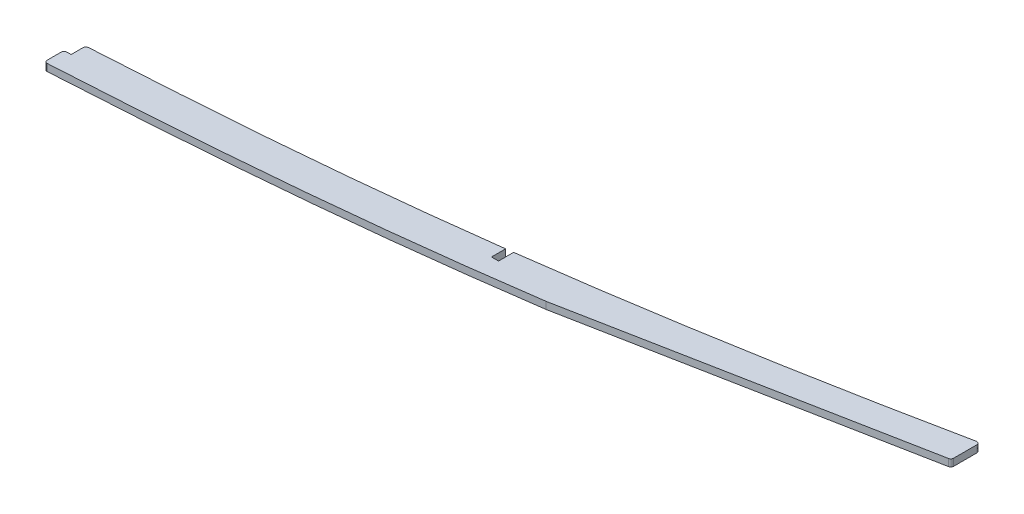
ISO-10303-21;
HEADER;
FILE_DESCRIPTION(('STEP AP214'),'2;1');
FILE_NAME('part.step','',(''),(''),'','','');
FILE_SCHEMA(('AUTOMOTIVE_DESIGN { 1 0 10303 214 1 1 1 1 }'));
ENDSEC;
DATA;
#1=APPLICATION_CONTEXT('core data for automotive mechanical design processes');
#2=APPLICATION_PROTOCOL_DEFINITION('international standard','automotive_design',2000,#1);
#3=PRODUCT_CONTEXT('',#1,'mechanical');
#4=PRODUCT('Part','Part','',(#3));
#5=PRODUCT_RELATED_PRODUCT_CATEGORY('part','',(#4));
#6=PRODUCT_DEFINITION_FORMATION('','',#4);
#7=PRODUCT_DEFINITION_CONTEXT('part definition',#1,'design');
#8=PRODUCT_DEFINITION('design','',#6,#7);
#9=PRODUCT_DEFINITION_SHAPE('','',#8);
#10=(LENGTH_UNIT() NAMED_UNIT(*) SI_UNIT(.MILLI.,.METRE.));
#11=(NAMED_UNIT(*) PLANE_ANGLE_UNIT() SI_UNIT($,.RADIAN.));
#12=(NAMED_UNIT(*) SI_UNIT($,.STERADIAN.) SOLID_ANGLE_UNIT());
#13=UNCERTAINTY_MEASURE_WITH_UNIT(LENGTH_MEASURE(1.E-05),#10,'distance_accuracy_value','');
#14=(GEOMETRIC_REPRESENTATION_CONTEXT(3) GLOBAL_UNCERTAINTY_ASSIGNED_CONTEXT((#13)) GLOBAL_UNIT_ASSIGNED_CONTEXT((#10,
#11,#12)) REPRESENTATION_CONTEXT('',''));
#15=CARTESIAN_POINT('',(0.,0.,0.));
#16=DIRECTION('',(0.,0.,1.));
#17=DIRECTION('',(1.,0.,0.));
#18=AXIS2_PLACEMENT_3D('',#15,#16,#17);
#19=CARTESIAN_POINT('',(2125.00064017427,1.5875,94.4800369448474));
#20=CARTESIAN_POINT('',(2149.04351205278,1.5875,93.497408198186));
#21=CARTESIAN_POINT('',(2173.08465693507,1.5875,92.4714303186568));
#22=CARTESIAN_POINT('',(2221.16051111618,1.5875,90.2825451342161));
#23=CARTESIAN_POINT('',(2245.19553408109,1.5875,89.1196551679897));
#24=CARTESIAN_POINT('',(2281.23975724731,1.5875,87.2213575710183));
#25=CARTESIAN_POINT('',(2293.25302693238,1.5875,86.5622387735997));
#26=CARTESIAN_POINT('',(2317.27629287288,1.5875,85.1853725215189));
#27=CARTESIAN_POINT('',(2329.28667496271,1.5875,84.4695877060572));
#28=CARTESIAN_POINT('',(2353.30043194924,1.5875,82.9360976908141));
#29=CARTESIAN_POINT('',(2365.30329886088,1.5875,82.1167454790412));
#30=CARTESIAN_POINT('',(2389.29570022096,1.5875,80.3032013832875));
#31=CARTESIAN_POINT('',(2401.28513168761,1.5875,79.3076590137664));
#32=CARTESIAN_POINT('',(2425.248015539,1.5875,77.1070272915958));
#33=CARTESIAN_POINT('',(2437.21939504412,1.5875,75.9021262287262));
#34=CARTESIAN_POINT('',(2461.1350429249,1.5875,73.2728607205226));
#35=CARTESIAN_POINT('',(2473.08021873022,1.5875,71.848649743833));
#36=CARTESIAN_POINT('',(2496.94588972892,1.5875,68.7864051538839));
#37=CARTESIAN_POINT('',(2508.86721006671,1.5875,67.1484398221377));
#38=CARTESIAN_POINT('',(2532.67675150176,1.5875,63.6755945009625));
#39=CARTESIAN_POINT('',(2544.56619473404,1.5875,61.8407677680709));
#40=CARTESIAN_POINT('',(2568.31735906903,1.5875,57.9931353056948));
#41=CARTESIAN_POINT('',(2580.17961126629,1.5875,55.980432346589));
#42=CARTESIAN_POINT('',(2603.8765766664,1.5875,51.794563265322));
#43=CARTESIAN_POINT('',(2615.71090980775,1.5875,49.6216949956207));
#44=CARTESIAN_POINT('',(2639.35036015543,1.5875,45.1250865007013));
#45=CARTESIAN_POINT('',(2651.15621950326,1.5875,42.8015133301686));
#46=CARTESIAN_POINT('',(2674.73471693345,1.5875,37.9973454558139));
#47=CARTESIAN_POINT('',(2686.50776170266,1.5875,35.5172707099935));
#48=CARTESIAN_POINT('',(2698.26092171884,1.5875,32.9414891543206));
#49=B_SPLINE_CURVE_WITH_KNOTS('',3,(#19,#20,#21,#22,#23,#24,#25,#26,#27,#28,#29,#30,#31,#32,#33,
#34,#35,#36,#37,#38,#39,#40,#41,#42,#43,#44,#45,#46,#47,#48),.UNSPECIFIED.,.F.,.F.,(4,2,2,2,2,2,
2,2,2,2,2,2,2,2,4),(0.,0.125,0.25,0.3125,0.375,0.4375,0.5,0.5625,0.625,0.6875,0.75,0.8125,0.875,
0.9375,1.),.UNSPECIFIED.);
#50=DIRECTION('',(0.,-1.,0.));
#51=VECTOR('',#50,1.);
#52=SURFACE_OF_LINEAR_EXTRUSION('',#49,#51);
#53=CARTESIAN_POINT('',(2517.14075146026,1.5875,65.9385305900614));
#54=CARTESIAN_POINT('',(2506.44324518488,1.5875,67.4803671494609));
#55=CARTESIAN_POINT('',(2495.73279615856,1.5875,68.9420592405899));
#56=CARTESIAN_POINT('',(2473.08021873022,1.5875,71.848649743833));
#57=CARTESIAN_POINT('',(2461.1350429249,1.5875,73.2728607205226));
#58=CARTESIAN_POINT('',(2437.21939504412,1.5875,75.9021262287262));
#59=CARTESIAN_POINT('',(2425.248015539,1.5875,77.1070272915958));
#60=CARTESIAN_POINT('',(2401.28513168761,1.5875,79.3076590137664));
#61=CARTESIAN_POINT('',(2389.29570022096,1.5875,80.3032013832875));
#62=CARTESIAN_POINT('',(2365.30329886088,1.5875,82.1167454790412));
#63=CARTESIAN_POINT('',(2353.30043194924,1.5875,82.9360976908141));
#64=CARTESIAN_POINT('',(2331.77885363362,1.5875,84.3104401345136));
#65=CARTESIAN_POINT('',(2322.26195370306,1.5875,84.8860367578641));
#66=CARTESIAN_POINT('',(2312.74397465339,1.5875,85.4413805531746));
#67=B_SPLINE_CURVE_WITH_KNOTS('',3,(#53,#54,#55,#56,#57,#58,#59,#60,#61,#62,#63,#64,#65,#66),
.UNSPECIFIED.,.F.,.F.,(4,2,2,2,2,2,4),(0.3254726612141,0.381618903286955,0.444118903286955,
0.506618903286955,0.569118903286955,0.631618903286955,0.681146242072855),.UNSPECIFIED.);
#68=CARTESIAN_POINT('',(2312.74398306396,1.5875,85.4415247011197));
#69=VERTEX_POINT('',#68);
#70=CARTESIAN_POINT('',(2517.14074629758,1.5875,65.9384947733818));
#71=VERTEX_POINT('',#70);
#72=EDGE_CURVE('E311',#69,#71,#67,.F.);
#73=ORIENTED_EDGE('',*,*,#72,.F.);
#74=DIRECTION('',(0.,-1.,0.));
#75=VECTOR('',#74,1.);
#76=CARTESIAN_POINT('',(2312.74397464853,1.5875,85.4413805534581));
#77=LINE('',#76,#75);
#78=CARTESIAN_POINT('',(2312.74398306217,-1.5875,85.4415246869222));
#79=VERTEX_POINT('',#78);
#80=EDGE_CURVE('E395',#69,#79,#77,.T.);
#81=ORIENTED_EDGE('',*,*,#80,.T.);
#82=CARTESIAN_POINT('',(2312.74397465001,-1.5875,85.4413805533716));
#83=CARTESIAN_POINT('',(2322.2619537008,-1.5875,84.8860367580003));
#84=CARTESIAN_POINT('',(2331.7788536325,-1.5875,84.3104401345854));
#85=CARTESIAN_POINT('',(2353.30043194924,-1.5875,82.9360976908141));
#86=CARTESIAN_POINT('',(2365.30329886088,-1.5875,82.1167454790412));
#87=CARTESIAN_POINT('',(2389.29570022096,-1.5875,80.3032013832875));
#88=CARTESIAN_POINT('',(2401.28513168761,-1.5875,79.3076590137664));
#89=CARTESIAN_POINT('',(2425.248015539,-1.5875,77.1070272915958));
#90=CARTESIAN_POINT('',(2437.21939504412,-1.5875,75.9021262287262));
#91=CARTESIAN_POINT('',(2461.1350429249,-1.5875,73.2728607205226));
#92=CARTESIAN_POINT('',(2473.08021873022,-1.5875,71.848649743833));
#93=CARTESIAN_POINT('',(2495.73279679608,-1.5875,68.9420591587886));
#94=CARTESIAN_POINT('',(2506.44324645882,-1.5875,67.4803669756025));
#95=CARTESIAN_POINT('',(2517.14075336885,-1.5875,65.9385303149748));
#96=B_SPLINE_CURVE_WITH_KNOTS('',3,(#82,#83,#84,#85,#86,#87,#88,#89,#90,#91,#92,#93,#94,#95),
.UNSPECIFIED.,.F.,.F.,(4,2,2,2,2,2,4),(0.325472661208244,0.375,0.4375,0.5,0.5625,0.625,
0.681146245411964),.UNSPECIFIED.);
#97=CARTESIAN_POINT('',(2517.14043307902,-1.58960583541235,65.9385552624042));
#98=VERTEX_POINT('',#97);
#99=EDGE_CURVE('E184',#79,#98,#96,.T.);
#100=ORIENTED_EDGE('',*,*,#99,.T.);
#101=DIRECTION('',(0.,-1.,0.));
#102=VECTOR('',#101,1.);
#103=CARTESIAN_POINT('',(2517.14,-0.0024999999999999,65.9386388982431));
#104=LINE('',#103,#102);
#105=EDGE_CURVE('E279',#98,#71,#104,.F.);
#106=ORIENTED_EDGE('',*,*,#105,.T.);
#107=EDGE_LOOP('',(#73,#81,#100,#106));
#108=FACE_BOUND('',#107,.T.);
#109=ADVANCED_FACE('F47',(#108),#52,.F.);
#110=CARTESIAN_POINT('',(2124.37830308858,1.5875,79.252749052653));
#111=CARTESIAN_POINT('',(2148.39751193199,1.5875,78.2710874108631));
#112=CARTESIAN_POINT('',(2196.44142591429,1.5875,76.2202304627624));
#113=CARTESIAN_POINT('',(2256.43632671494,1.5875,73.3193029777612));
#114=CARTESIAN_POINT('',(2304.39682766951,1.5875,70.6868537158113));
#115=CARTESIAN_POINT('',(2340.34200336636,1.5875,68.5440440460852));
#116=CARTESIAN_POINT('',(2376.16909953384,1.5875,66.0999017724206));
#117=CARTESIAN_POINT('',(2423.79225447921,1.5875,62.148433446528));
#118=CARTESIAN_POINT('',(2483.11730251875,1.5875,55.6326510171635));
#119=CARTESIAN_POINT('',(2554.04445691108,1.5875,45.2265308139822));
#120=CARTESIAN_POINT('',(2611.9061277636,1.5875,34.9727556057638));
#121=CARTESIAN_POINT('',(2648.22954061154,1.5875,27.8453657370829));
#122=CARTESIAN_POINT('',(2665.29052708524,1.5875,24.3690973591681));
#123=CARTESIAN_POINT('',(2678.0413738897,1.5875,21.7219433950603));
#124=CARTESIAN_POINT('',(2688.64049273064,1.5875,19.4481755033962));
#125=CARTESIAN_POINT('',(2694.99840626553,1.5875,18.0547973486536));
#126=B_SPLINE_CURVE_WITH_KNOTS('',3,(#110,#111,#112,#113,#114,#115,#116,#117,#118,#119,#120,
#121,#122,#123,#124,#125),.UNSPECIFIED.,.F.,.F.,(4,1,1,1,1,1,1,1,1,1,1,1,1,4),(0.,0.125,0.25,
0.3125,0.375,0.4375,0.5,0.625,0.75,0.875,0.931953524477232,0.943294603731027,0.965976762238616,
1.),.UNSPECIFIED.);
#127=DIRECTION('',(0.,-1.,0.));
#128=VECTOR('',#127,1.);
#129=SURFACE_OF_LINEAR_EXTRUSION('',#126,#128);
#130=CARTESIAN_POINT('',(2487.61258124876,-1.5875,54.6140340984797));
#131=CARTESIAN_POINT('',(2486.09972739751,-1.5875,54.8115871458127));
#132=CARTESIAN_POINT('',(2460.90329305909,-1.5875,58.0724577650065));
#133=CARTESIAN_POINT('',(2423.79225447921,-1.5875,62.148433446528));
#134=CARTESIAN_POINT('',(2376.16909953384,-1.5875,66.0999017724206));
#135=CARTESIAN_POINT('',(2344.12135262642,-1.5875,68.2862149647029));
#136=CARTESIAN_POINT('',(2323.96019254909,-1.5875,69.5154701849957));
#137=CARTESIAN_POINT('',(2315.77027851908,-1.5875,69.9981689116351));
#138=B_SPLINE_CURVE_WITH_KNOTS('',3,(#130,#131,#132,#133,#134,#135,#136,#137),.UNSPECIFIED.,.F.,
.F.,(4,1,1,1,1,4),(0.332279107493079,0.340264824562933,0.465264824562933,0.527764824562933,
0.590264824562933,0.632985717069855),.UNSPECIFIED.);
#139=CARTESIAN_POINT('',(2315.7703230098,-1.5875,69.9989237825159));
#140=VERTEX_POINT('',#139);
#141=CARTESIAN_POINT('',(2487.61249997359,-1.58964788720698,54.6136835370382));
#142=VERTEX_POINT('',#141);
#143=EDGE_CURVE('E257',#140,#142,#138,.F.);
#144=ORIENTED_EDGE('',*,*,#143,.F.);
#145=DIRECTION('',(0.,-1.,0.));
#146=VECTOR('',#145,1.);
#147=CARTESIAN_POINT('',(2315.77027816457,-1.5875,69.9981689325292));
#148=LINE('',#147,#146);
#149=CARTESIAN_POINT('',(2315.77027816457,1.5875,69.9981689325292));
#150=VERTEX_POINT('',#149);
#151=EDGE_CURVE('E259',#140,#150,#148,.F.);
#152=ORIENTED_EDGE('',*,*,#151,.T.);
#153=CARTESIAN_POINT('',(2487.6125,1.5875,54.6140447081878));
#154=VERTEX_POINT('',#153);
#155=EDGE_CURVE('E199',#150,#154,#126,.T.);
#156=ORIENTED_EDGE('',*,*,#155,.T.);
#157=DIRECTION('',(0.,1.,0.));
#158=VECTOR('',#157,1.);
#159=CARTESIAN_POINT('',(2487.6125,-1.5925,54.6140447081878));
#160=LINE('',#159,#158);
#161=EDGE_CURVE('E289',#142,#154,#160,.T.);
#162=ORIENTED_EDGE('',*,*,#161,.F.);
#163=EDGE_LOOP('',(#144,#152,#156,#162));
#164=FACE_BOUND('',#163,.T.);
#165=ADVANCED_FACE('F231',(#164),#129,.T.);
#166=CARTESIAN_POINT('',(2669.54,1.5875,7.61745278554091E-11));
#167=DIRECTION('',(-1.,0.,0.));
#168=DIRECTION('',(0.,0.,1.));
#169=AXIS2_PLACEMENT_3D('',#166,#167,#168);
#170=PLANE('',#169);
#171=DIRECTION('',(0.,0.,-1.));
#172=VECTOR('',#171,1.);
#173=CARTESIAN_POINT('',(2669.54,-1.5875,7.61745278554091E-11));
#174=LINE('',#173,#172);
#175=CARTESIAN_POINT('',(2669.54,-1.5875,35.4589734963627));
#176=VERTEX_POINT('',#175);
#177=CARTESIAN_POINT('',(2669.54,-1.5875,25.0443756031255));
#178=VERTEX_POINT('',#177);
#179=EDGE_CURVE('E417',#176,#178,#174,.T.);
#180=ORIENTED_EDGE('',*,*,#179,.T.);
#181=DIRECTION('',(0.,1.,0.));
#182=VECTOR('',#181,1.);
#183=CARTESIAN_POINT('',(2669.54,1.5875,25.0443756031255));
#184=LINE('',#183,#182);
#185=CARTESIAN_POINT('',(2669.54,1.5875,25.0443756031255));
#186=VERTEX_POINT('',#185);
#187=EDGE_CURVE('E386',#178,#186,#184,.T.);
#188=ORIENTED_EDGE('',*,*,#187,.T.);
#189=DIRECTION('',(0.,0.,-1.));
#190=VECTOR('',#189,1.);
#191=CARTESIAN_POINT('',(2669.54,1.5875,7.61745278554091E-11));
#192=LINE('',#191,#190);
#193=CARTESIAN_POINT('',(2669.54,1.5875,35.4589734963627));
#194=VERTEX_POINT('',#193);
#195=EDGE_CURVE('E306',#194,#186,#192,.T.);
#196=ORIENTED_EDGE('',*,*,#195,.F.);
#197=DIRECTION('',(0.,1.,0.));
#198=VECTOR('',#197,1.);
#199=CARTESIAN_POINT('',(2669.54,1.5875,35.4589734963627));
#200=LINE('',#199,#198);
#201=EDGE_CURVE('E381',#194,#176,#200,.F.);
#202=ORIENTED_EDGE('',*,*,#201,.T.);
#203=EDGE_LOOP('',(#180,#188,#196,#202));
#204=FACE_BOUND('',#203,.T.);
#205=ADVANCED_FACE('F229',(#204),#170,.F.);
#206=CARTESIAN_POINT('',(2490.78749999026,1.5875,54.1968621651898));
#207=VERTEX_POINT('',#206);
#208=CARTESIAN_POINT('',(2668.01254575253,1.5875,23.8007449061504));
#209=VERTEX_POINT('',#208);
#210=EDGE_CURVE('E194',#207,#209,#126,.T.);
#211=ORIENTED_EDGE('',*,*,#210,.T.);
#212=DIRECTION('',(0.,-1.,0.));
#213=VECTOR('',#212,1.);
#214=CARTESIAN_POINT('',(2668.01254575253,1.5875,23.8007449061503));
#215=LINE('',#214,#213);
#216=CARTESIAN_POINT('',(2668.01254788894,-1.5875,23.8007552219838));
#217=VERTEX_POINT('',#216);
#218=EDGE_CURVE('E375',#209,#217,#215,.T.);
#219=ORIENTED_EDGE('',*,*,#218,.T.);
#220=CARTESIAN_POINT('',(2668.01254575334,-1.5875,23.8007449059823));
#221=CARTESIAN_POINT('',(2666.39648104322,-1.5875,24.13529979018));
#222=CARTESIAN_POINT('',(2662.65415415635,-1.5875,24.9062726191806));
#223=CARTESIAN_POINT('',(2648.22954061154,-1.5875,27.8453657370829));
#224=CARTESIAN_POINT('',(2611.9061277636,-1.5875,34.9727556057638));
#225=CARTESIAN_POINT('',(2556.60294893084,-1.5875,44.7731356448457));
#226=CARTESIAN_POINT('',(2511.89346831468,-1.5875,51.4065025037802));
#227=CARTESIAN_POINT('',(2490.78758843823,-1.5875,54.1968504717389));
#228=B_SPLINE_CURVE_WITH_KNOTS('',3,(#220,#221,#222,#223,#224,#225,#226,#227),.UNSPECIFIED.,.F.,
.F.,(4,1,1,1,1,4),(0.638572683457684,0.647196529833476,0.658537609087271,0.715491133564503,
0.840491133564503,0.951918450106819),.UNSPECIFIED.);
#229=CARTESIAN_POINT('',(2490.7874999778,-1.58962136670422,54.1964701715005));
#230=VERTEX_POINT('',#229);
#231=EDGE_CURVE('E440',#230,#217,#228,.F.);
#232=ORIENTED_EDGE('',*,*,#231,.F.);
#233=DIRECTION('',(0.,1.,0.));
#234=VECTOR('',#233,1.);
#235=CARTESIAN_POINT('',(2490.78749999026,-1.5925,54.1968621651898));
#236=LINE('',#235,#234);
#237=EDGE_CURVE('E292',#230,#207,#236,.T.);
#238=ORIENTED_EDGE('',*,*,#237,.T.);
#239=EDGE_LOOP('',(#211,#219,#232,#238));
#240=FACE_BOUND('',#239,.T.);
#241=ADVANCED_FACE('F224',(#240),#129,.T.);
#242=CARTESIAN_POINT('',(0.,1.5875,0.));
#243=DIRECTION('',(0.,1.,0.));
#244=DIRECTION('',(0.,0.,1.));
#245=AXIS2_PLACEMENT_3D('',#242,#243,#244);
#246=PLANE('',#245);
#247=ORIENTED_EDGE('',*,*,#155,.F.);
#248=CARTESIAN_POINT('',(2315.845,1.5875,71.2659688565353));
#249=DIRECTION('',(0.,1.,0.));
#250=DIRECTION('',(0.,0.,1.));
#251=AXIS2_PLACEMENT_3D('',#248,#249,#250);
#252=CIRCLE('',#251,1.27);
#253=CARTESIAN_POINT('',(2314.575,1.5875,71.2659688565353));
#254=VERTEX_POINT('',#253);
#255=EDGE_CURVE('E188',#150,#254,#252,.T.);
#256=ORIENTED_EDGE('',*,*,#255,.T.);
#257=DIRECTION('',(0.,0.,-1.));
#258=VECTOR('',#257,1.);
#259=CARTESIAN_POINT('',(2314.575,1.5875,0.));
#260=LINE('',#259,#258);
#261=CARTESIAN_POINT('',(2314.575,1.5875,76.6042072105905));
#262=VERTEX_POINT('',#261);
#263=EDGE_CURVE('E173',#262,#254,#260,.T.);
#264=ORIENTED_EDGE('',*,*,#263,.F.);
#265=DIRECTION('',(1.,0.,0.));
#266=VECTOR('',#265,1.);
#267=CARTESIAN_POINT('',(0.,1.5875,76.6042072105905));
#268=LINE('',#267,#266);
#269=CARTESIAN_POINT('',(2312.67,1.5875,76.6042072105905));
#270=VERTEX_POINT('',#269);
#271=EDGE_CURVE('E164',#270,#262,#268,.T.);
#272=ORIENTED_EDGE('',*,*,#271,.F.);
#273=CARTESIAN_POINT('',(2312.67,1.5875,77.8742072105905));
#274=DIRECTION('',(0.,1.,0.));
#275=DIRECTION('',(0.,0.,1.));
#276=AXIS2_PLACEMENT_3D('',#273,#274,#275);
#277=CIRCLE('',#276,1.27);
#278=CARTESIAN_POINT('',(2311.4,1.5875,77.8742072105905));
#279=VERTEX_POINT('',#278);
#280=EDGE_CURVE('E421',#270,#279,#277,.T.);
#281=ORIENTED_EDGE('',*,*,#280,.T.);
#282=DIRECTION('',(0.,0.,1.));
#283=VECTOR('',#282,1.);
#284=CARTESIAN_POINT('',(2311.4,1.5875,6.72412135142371E-11));
#285=LINE('',#284,#283);
#286=CARTESIAN_POINT('',(2311.4,1.5875,84.1735368125441));
#287=VERTEX_POINT('',#286);
#288=EDGE_CURVE('E174',#279,#287,#285,.T.);
#289=ORIENTED_EDGE('',*,*,#288,.T.);
#290=CARTESIAN_POINT('',(2312.67,1.5875,84.1735368125441));
#291=DIRECTION('',(0.,1.,0.));
#292=DIRECTION('',(0.,0.,1.));
#293=AXIS2_PLACEMENT_3D('',#290,#291,#292);
#294=CIRCLE('',#293,1.27);
#295=EDGE_CURVE('E419',#287,#69,#294,.T.);
#296=ORIENTED_EDGE('',*,*,#295,.T.);
#297=ORIENTED_EDGE('',*,*,#72,.T.);
#298=DIRECTION('',(-0.981858268087982,0.,0.189616300426069));
#299=VECTOR('',#298,1.);
#300=CARTESIAN_POINT('',(102.778324828958,1.5875,532.199751744926));
#301=LINE('',#300,#299);
#302=CARTESIAN_POINT('',(2668.51081270154,1.5875,36.7059334968343));
#303=VERTEX_POINT('',#302);
#304=EDGE_CURVE('E296',#303,#71,#301,.T.);
#305=ORIENTED_EDGE('',*,*,#304,.F.);
#306=CARTESIAN_POINT('',(2668.27,1.5875,35.4589734963626));
#307=DIRECTION('',(0.,1.,0.));
#308=DIRECTION('',(0.,0.,1.));
#309=AXIS2_PLACEMENT_3D('',#306,#307,#308);
#310=CIRCLE('',#309,1.27);
#311=EDGE_CURVE('E262',#303,#194,#310,.T.);
#312=ORIENTED_EDGE('',*,*,#311,.T.);
#313=ORIENTED_EDGE('',*,*,#195,.T.);
#314=CARTESIAN_POINT('',(2668.27,1.5875,25.0443756031255));
#315=DIRECTION('',(0.,1.,0.));
#316=DIRECTION('',(0.,0.,1.));
#317=AXIS2_PLACEMENT_3D('',#314,#315,#316);
#318=CIRCLE('',#317,1.27);
#319=EDGE_CURVE('E426',#186,#209,#318,.T.);
#320=ORIENTED_EDGE('',*,*,#319,.T.);
#321=ORIENTED_EDGE('',*,*,#210,.F.);
#322=DIRECTION('',(0.,0.,-1.));
#323=VECTOR('',#322,1.);
#324=CARTESIAN_POINT('',(2490.7875,1.5875,-1.6345529996214E-10));
#325=LINE('',#324,#323);
#326=CARTESIAN_POINT('',(2490.7875,1.5875,60.9640446821163));
#327=VERTEX_POINT('',#326);
#328=EDGE_CURVE('E278',#327,#207,#325,.T.);
#329=ORIENTED_EDGE('',*,*,#328,.F.);
#330=DIRECTION('',(1.,0.,0.));
#331=VECTOR('',#330,1.);
#332=CARTESIAN_POINT('',(0.,1.5875,60.9640446821163));
#333=LINE('',#332,#331);
#334=CARTESIAN_POINT('',(2487.6125,1.5875,60.9640446821163));
#335=VERTEX_POINT('',#334);
#336=EDGE_CURVE('E274',#335,#327,#333,.T.);
#337=ORIENTED_EDGE('',*,*,#336,.F.);
#338=DIRECTION('',(0.,0.,1.));
#339=VECTOR('',#338,1.);
#340=CARTESIAN_POINT('',(2487.6125,1.5875,0.));
#341=LINE('',#340,#339);
#342=EDGE_CURVE('E282',#154,#335,#341,.T.);
#343=ORIENTED_EDGE('',*,*,#342,.F.);
#344=EDGE_LOOP('',(#247,#256,#264,#272,#281,#289,#296,#297,#305,#312,#313,#320,#321,#329,#337,#343));
#345=FACE_BOUND('',#344,.T.);
#346=ADVANCED_FACE('F187',(#345),#246,.T.);
#347=CARTESIAN_POINT('',(0.,-1.5875,0.));
#348=DIRECTION('',(0.,1.,0.));
#349=DIRECTION('',(0.,0.,1.));
#350=AXIS2_PLACEMENT_3D('',#347,#348,#349);
#351=PLANE('',#350);
#352=DIRECTION('',(0.,0.,-1.));
#353=VECTOR('',#352,1.);
#354=CARTESIAN_POINT('',(2314.575,-1.5875,0.));
#355=LINE('',#354,#353);
#356=CARTESIAN_POINT('',(2314.575,-1.5875,76.6042072105905));
#357=VERTEX_POINT('',#356);
#358=CARTESIAN_POINT('',(2314.575,-1.5875,71.2659688565353));
#359=VERTEX_POINT('',#358);
#360=EDGE_CURVE('E182',#357,#359,#355,.T.);
#361=ORIENTED_EDGE('',*,*,#360,.T.);
#362=CARTESIAN_POINT('',(2315.845,-1.5875,71.2659688565353));
#363=DIRECTION('',(0.,1.,0.));
#364=DIRECTION('',(0.,0.,1.));
#365=AXIS2_PLACEMENT_3D('',#362,#363,#364);
#366=CIRCLE('',#365,1.27);
#367=EDGE_CURVE('E370',#359,#140,#366,.F.);
#368=ORIENTED_EDGE('',*,*,#367,.T.);
#369=ORIENTED_EDGE('',*,*,#143,.T.);
#370=DIRECTION('',(0.,0.,1.));
#371=VECTOR('',#370,1.);
#372=CARTESIAN_POINT('',(2487.6125,-1.5875,0.));
#373=LINE('',#372,#371);
#374=CARTESIAN_POINT('',(2487.6125,-1.5875,60.9640446821163));
#375=VERTEX_POINT('',#374);
#376=EDGE_CURVE('E455',#142,#375,#373,.T.);
#377=ORIENTED_EDGE('',*,*,#376,.T.);
#378=DIRECTION('',(1.,0.,0.));
#379=VECTOR('',#378,1.);
#380=CARTESIAN_POINT('',(0.,-1.5875,60.9640446821163));
#381=LINE('',#380,#379);
#382=CARTESIAN_POINT('',(2490.7875,-1.5875,60.9640446821163));
#383=VERTEX_POINT('',#382);
#384=EDGE_CURVE('E449',#375,#383,#381,.T.);
#385=ORIENTED_EDGE('',*,*,#384,.T.);
#386=DIRECTION('',(0.,0.,-1.));
#387=VECTOR('',#386,1.);
#388=CARTESIAN_POINT('',(2490.7875,-1.5875,-1.6345529996214E-10));
#389=LINE('',#388,#387);
#390=EDGE_CURVE('E443',#383,#230,#389,.T.);
#391=ORIENTED_EDGE('',*,*,#390,.T.);
#392=ORIENTED_EDGE('',*,*,#231,.T.);
#393=CARTESIAN_POINT('',(2668.27,-1.5875,25.0443756031255));
#394=DIRECTION('',(0.,1.,0.));
#395=DIRECTION('',(0.,0.,1.));
#396=AXIS2_PLACEMENT_3D('',#393,#394,#395);
#397=CIRCLE('',#396,1.27);
#398=EDGE_CURVE('E360',#217,#178,#397,.F.);
#399=ORIENTED_EDGE('',*,*,#398,.T.);
#400=ORIENTED_EDGE('',*,*,#179,.F.);
#401=CARTESIAN_POINT('',(2668.27,-1.5875,35.4589734963626));
#402=DIRECTION('',(0.,1.,0.));
#403=DIRECTION('',(0.,0.,1.));
#404=AXIS2_PLACEMENT_3D('',#401,#402,#403);
#405=CIRCLE('',#404,1.27);
#406=CARTESIAN_POINT('',(2668.51081270154,-1.5875,36.7059334968345));
#407=VERTEX_POINT('',#406);
#408=EDGE_CURVE('E355',#176,#407,#405,.F.);
#409=ORIENTED_EDGE('',*,*,#408,.T.);
#410=DIRECTION('',(-0.981858268087982,0.,0.189616300426069));
#411=VECTOR('',#410,1.);
#412=CARTESIAN_POINT('',(102.778324828958,-1.5875,532.199751744926));
#413=LINE('',#412,#411);
#414=EDGE_CURVE('E202',#407,#98,#413,.T.);
#415=ORIENTED_EDGE('',*,*,#414,.T.);
#416=ORIENTED_EDGE('',*,*,#99,.F.);
#417=CARTESIAN_POINT('',(2312.67,-1.5875,84.1735368125441));
#418=DIRECTION('',(0.,1.,0.));
#419=DIRECTION('',(0.,0.,1.));
#420=AXIS2_PLACEMENT_3D('',#417,#418,#419);
#421=CIRCLE('',#420,1.27);
#422=CARTESIAN_POINT('',(2311.4,-1.5875,84.1735368125441));
#423=VERTEX_POINT('',#422);
#424=EDGE_CURVE('E63',#79,#423,#421,.F.);
#425=ORIENTED_EDGE('',*,*,#424,.T.);
#426=DIRECTION('',(0.,0.,1.));
#427=VECTOR('',#426,1.);
#428=CARTESIAN_POINT('',(2311.4,-1.5875,6.72412135142371E-11));
#429=LINE('',#428,#427);
#430=CARTESIAN_POINT('',(2311.4,-1.5875,77.8742072105905));
#431=VERTEX_POINT('',#430);
#432=EDGE_CURVE('E420',#431,#423,#429,.T.);
#433=ORIENTED_EDGE('',*,*,#432,.F.);
#434=CARTESIAN_POINT('',(2312.67,-1.5875,77.8742072105905));
#435=DIRECTION('',(0.,1.,0.));
#436=DIRECTION('',(0.,0.,1.));
#437=AXIS2_PLACEMENT_3D('',#434,#435,#436);
#438=CIRCLE('',#437,1.27);
#439=CARTESIAN_POINT('',(2312.67,-1.5875,76.6042072105905));
#440=VERTEX_POINT('',#439);
#441=EDGE_CURVE('E353',#431,#440,#438,.F.);
#442=ORIENTED_EDGE('',*,*,#441,.T.);
#443=DIRECTION('',(1.,0.,0.));
#444=VECTOR('',#443,1.);
#445=CARTESIAN_POINT('',(0.,-1.5875,76.6042072105905));
#446=LINE('',#445,#444);
#447=EDGE_CURVE('E463',#440,#357,#446,.T.);
#448=ORIENTED_EDGE('',*,*,#447,.T.);
#449=EDGE_LOOP('',(#361,#368,#369,#377,#385,#391,#392,#399,#400,#409,#415,#416,#425,#433,#442,#448));
#450=FACE_BOUND('',#449,.T.);
#451=ADVANCED_FACE('F232',(#450),#351,.F.);
#452=CARTESIAN_POINT('',(102.778324828958,-1.5925,532.199751744926));
#453=DIRECTION('',(-0.189616300426069,0.,-0.981858268087982));
#454=DIRECTION('',(-0.981858268087982,0.,0.189616300426069));
#455=AXIS2_PLACEMENT_3D('',#452,#453,#454);
#456=PLANE('',#455);
#457=ORIENTED_EDGE('',*,*,#414,.F.);
#458=DIRECTION('',(0.,1.,0.));
#459=VECTOR('',#458,1.);
#460=CARTESIAN_POINT('',(2668.51081270154,-1.5925,36.7059334968344));
#461=LINE('',#460,#459);
#462=EDGE_CURVE('E11',#407,#303,#461,.T.);
#463=ORIENTED_EDGE('',*,*,#462,.T.);
#464=ORIENTED_EDGE('',*,*,#304,.T.);
#465=ORIENTED_EDGE('',*,*,#105,.F.);
#466=EDGE_LOOP('',(#457,#463,#464,#465));
#467=FACE_BOUND('',#466,.T.);
#468=ADVANCED_FACE('F513',(#467),#456,.F.);
#469=CARTESIAN_POINT('',(0.,-1.5925,60.9640446821163));
#470=DIRECTION('',(0.,0.,1.));
#471=DIRECTION('',(1.,0.,0.));
#472=AXIS2_PLACEMENT_3D('',#469,#470,#471);
#473=PLANE('',#472);
#474=DIRECTION('',(0.,1.,0.));
#475=VECTOR('',#474,1.);
#476=CARTESIAN_POINT('',(2487.6125,-1.5925,60.9640446821163));
#477=LINE('',#476,#475);
#478=EDGE_CURVE('E269',#375,#335,#477,.T.);
#479=ORIENTED_EDGE('',*,*,#478,.T.);
#480=ORIENTED_EDGE('',*,*,#336,.T.);
#481=DIRECTION('',(0.,1.,0.));
#482=VECTOR('',#481,1.);
#483=CARTESIAN_POINT('',(2490.7875,-1.5925,60.9640446821163));
#484=LINE('',#483,#482);
#485=EDGE_CURVE('E286',#383,#327,#484,.T.);
#486=ORIENTED_EDGE('',*,*,#485,.F.);
#487=ORIENTED_EDGE('',*,*,#384,.F.);
#488=EDGE_LOOP('',(#479,#480,#486,#487));
#489=FACE_BOUND('',#488,.T.);
#490=ADVANCED_FACE('F511',(#489),#473,.F.);
#491=CARTESIAN_POINT('',(2487.6125,-1.5925,0.));
#492=DIRECTION('',(-1.,0.,0.));
#493=DIRECTION('',(0.,0.,1.));
#494=AXIS2_PLACEMENT_3D('',#491,#492,#493);
#495=PLANE('',#494);
#496=ORIENTED_EDGE('',*,*,#161,.T.);
#497=ORIENTED_EDGE('',*,*,#342,.T.);
#498=ORIENTED_EDGE('',*,*,#478,.F.);
#499=ORIENTED_EDGE('',*,*,#376,.F.);
#500=EDGE_LOOP('',(#496,#497,#498,#499));
#501=FACE_BOUND('',#500,.T.);
#502=ADVANCED_FACE('F479',(#501),#495,.F.);
#503=CARTESIAN_POINT('',(2490.7875,-1.5925,-1.6345529996214E-10));
#504=DIRECTION('',(1.,0.,0.));
#505=DIRECTION('',(0.,0.,-1.));
#506=AXIS2_PLACEMENT_3D('',#503,#504,#505);
#507=PLANE('',#506);
#508=ORIENTED_EDGE('',*,*,#485,.T.);
#509=ORIENTED_EDGE('',*,*,#328,.T.);
#510=ORIENTED_EDGE('',*,*,#237,.F.);
#511=ORIENTED_EDGE('',*,*,#390,.F.);
#512=EDGE_LOOP('',(#508,#509,#510,#511));
#513=FACE_BOUND('',#512,.T.);
#514=ADVANCED_FACE('F509',(#513),#507,.F.);
#515=CARTESIAN_POINT('',(2314.575,-1.5925,0.));
#516=DIRECTION('',(1.,0.,0.));
#517=DIRECTION('',(0.,0.,-1.));
#518=AXIS2_PLACEMENT_3D('',#515,#516,#517);
#519=PLANE('',#518);
#520=ORIENTED_EDGE('',*,*,#263,.T.);
#521=DIRECTION('',(0.,1.,0.));
#522=VECTOR('',#521,1.);
#523=CARTESIAN_POINT('',(2314.575,-1.5925,71.2659688565353));
#524=LINE('',#523,#522);
#525=EDGE_CURVE('E362',#254,#359,#524,.F.);
#526=ORIENTED_EDGE('',*,*,#525,.T.);
#527=ORIENTED_EDGE('',*,*,#360,.F.);
#528=DIRECTION('',(0.,1.,0.));
#529=VECTOR('',#528,1.);
#530=CARTESIAN_POINT('',(2314.575,-1.5925,76.6042072105905));
#531=LINE('',#530,#529);
#532=EDGE_CURVE('E168',#357,#262,#531,.T.);
#533=ORIENTED_EDGE('',*,*,#532,.T.);
#534=EDGE_LOOP('',(#520,#526,#527,#533));
#535=FACE_BOUND('',#534,.T.);
#536=ADVANCED_FACE('F179',(#535),#519,.F.);
#537=CARTESIAN_POINT('',(0.,-1.5925,76.6042072105905));
#538=DIRECTION('',(0.,0.,1.));
#539=DIRECTION('',(1.,0.,0.));
#540=AXIS2_PLACEMENT_3D('',#537,#538,#539);
#541=PLANE('',#540);
#542=ORIENTED_EDGE('',*,*,#447,.F.);
#543=DIRECTION('',(0.,1.,0.));
#544=VECTOR('',#543,1.);
#545=CARTESIAN_POINT('',(2312.67,1.5875,76.6042072105905));
#546=LINE('',#545,#544);
#547=EDGE_CURVE('E56',#440,#270,#546,.T.);
#548=ORIENTED_EDGE('',*,*,#547,.T.);
#549=ORIENTED_EDGE('',*,*,#271,.T.);
#550=ORIENTED_EDGE('',*,*,#532,.F.);
#551=EDGE_LOOP('',(#542,#548,#549,#550));
#552=FACE_BOUND('',#551,.T.);
#553=ADVANCED_FACE('F167',(#552),#541,.F.);
#554=CARTESIAN_POINT('',(2311.4,-1.5925,6.72412135142371E-11));
#555=DIRECTION('',(-1.,0.,0.));
#556=DIRECTION('',(0.,0.,1.));
#557=AXIS2_PLACEMENT_3D('',#554,#555,#556);
#558=PLANE('',#557);
#559=ORIENTED_EDGE('',*,*,#432,.T.);
#560=DIRECTION('',(0.,1.,0.));
#561=VECTOR('',#560,1.);
#562=CARTESIAN_POINT('',(2311.4,1.5875,84.1735368125441));
#563=LINE('',#562,#561);
#564=EDGE_CURVE('E391',#423,#287,#563,.T.);
#565=ORIENTED_EDGE('',*,*,#564,.T.);
#566=ORIENTED_EDGE('',*,*,#288,.F.);
#567=DIRECTION('',(0.,1.,0.));
#568=VECTOR('',#567,1.);
#569=CARTESIAN_POINT('',(2311.4,-1.5875,77.8742072105905));
#570=LINE('',#569,#568);
#571=EDGE_CURVE('E70',#279,#431,#570,.F.);
#572=ORIENTED_EDGE('',*,*,#571,.T.);
#573=EDGE_LOOP('',(#559,#565,#566,#572));
#574=FACE_BOUND('',#573,.T.);
#575=ADVANCED_FACE('F337',(#574),#558,.T.);
#576=CARTESIAN_POINT('',(2315.845,-0.0024999999999999,71.2659688565353));
#577=DIRECTION('',(0.,-1.,0.));
#578=DIRECTION('',(0.,0.,-1.));
#579=AXIS2_PLACEMENT_3D('',#576,#577,#578);
#580=CYLINDRICAL_SURFACE('',#579,1.27);
#581=ORIENTED_EDGE('',*,*,#367,.F.);
#582=ORIENTED_EDGE('',*,*,#525,.F.);
#583=ORIENTED_EDGE('',*,*,#255,.F.);
#584=ORIENTED_EDGE('',*,*,#151,.F.);
#585=EDGE_LOOP('',(#581,#582,#583,#584));
#586=FACE_BOUND('',#585,.T.);
#587=ADVANCED_FACE('F332',(#586),#580,.T.);
#588=CARTESIAN_POINT('',(2668.27,0.,25.0443756031255));
#589=DIRECTION('',(0.,-1.,0.));
#590=DIRECTION('',(0.,0.,-1.));
#591=AXIS2_PLACEMENT_3D('',#588,#589,#590);
#592=CYLINDRICAL_SURFACE('',#591,1.27);
#593=ORIENTED_EDGE('',*,*,#319,.F.);
#594=ORIENTED_EDGE('',*,*,#187,.F.);
#595=ORIENTED_EDGE('',*,*,#398,.F.);
#596=ORIENTED_EDGE('',*,*,#218,.F.);
#597=EDGE_LOOP('',(#593,#594,#595,#596));
#598=FACE_BOUND('',#597,.T.);
#599=ADVANCED_FACE('F336',(#598),#592,.T.);
#600=CARTESIAN_POINT('',(2312.67,-0.0024999999999999,84.1735368125441));
#601=DIRECTION('',(0.,-1.,0.));
#602=DIRECTION('',(0.,0.,-1.));
#603=AXIS2_PLACEMENT_3D('',#600,#601,#602);
#604=CYLINDRICAL_SURFACE('',#603,1.27);
#605=ORIENTED_EDGE('',*,*,#424,.F.);
#606=ORIENTED_EDGE('',*,*,#80,.F.);
#607=ORIENTED_EDGE('',*,*,#295,.F.);
#608=ORIENTED_EDGE('',*,*,#564,.F.);
#609=EDGE_LOOP('',(#605,#606,#607,#608));
#610=FACE_BOUND('',#609,.T.);
#611=ADVANCED_FACE('F341',(#610),#604,.T.);
#612=CARTESIAN_POINT('',(2312.67,-1.5925,77.8742072105905));
#613=DIRECTION('',(0.,-1.,0.));
#614=DIRECTION('',(0.,0.,-1.));
#615=AXIS2_PLACEMENT_3D('',#612,#613,#614);
#616=CYLINDRICAL_SURFACE('',#615,1.27);
#617=ORIENTED_EDGE('',*,*,#441,.F.);
#618=ORIENTED_EDGE('',*,*,#571,.F.);
#619=ORIENTED_EDGE('',*,*,#280,.F.);
#620=ORIENTED_EDGE('',*,*,#547,.F.);
#621=EDGE_LOOP('',(#617,#618,#619,#620));
#622=FACE_BOUND('',#621,.T.);
#623=ADVANCED_FACE('F344',(#622),#616,.T.);
#624=CARTESIAN_POINT('',(2668.27,-1.5925,35.4589734963626));
#625=DIRECTION('',(0.,1.,0.));
#626=DIRECTION('',(0.,0.,1.));
#627=AXIS2_PLACEMENT_3D('',#624,#625,#626);
#628=CYLINDRICAL_SURFACE('',#627,1.27);
#629=ORIENTED_EDGE('',*,*,#408,.F.);
#630=ORIENTED_EDGE('',*,*,#201,.F.);
#631=ORIENTED_EDGE('',*,*,#311,.F.);
#632=ORIENTED_EDGE('',*,*,#462,.F.);
#633=EDGE_LOOP('',(#629,#630,#631,#632));
#634=FACE_BOUND('',#633,.T.);
#635=ADVANCED_FACE('F49',(#634),#628,.T.);
#636=CLOSED_SHELL('',(#109,#165,#205,#241,#346,#451,#468,#490,#502,#514,#536,#553,#575,#587,
#599,#611,#623,#635));
#637=MANIFOLD_SOLID_BREP('B2',#636);
#638=ADVANCED_BREP_SHAPE_REPRESENTATION('',(#18,#637),#14);
#639=SHAPE_DEFINITION_REPRESENTATION(#9,#638);
ENDSEC;
END-ISO-10303-21;
